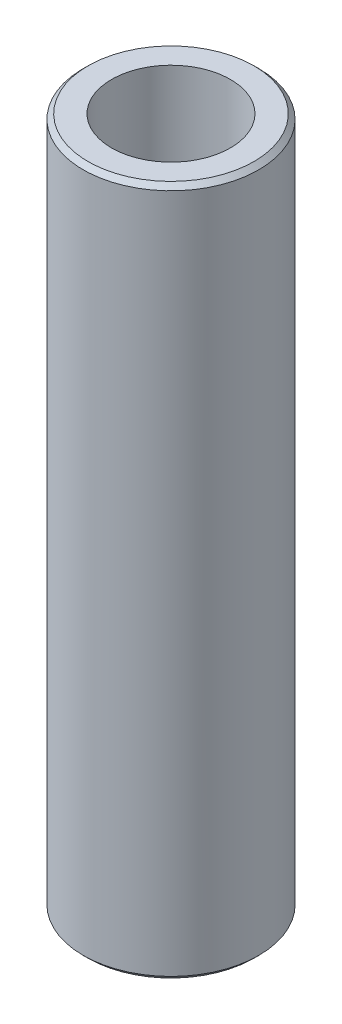
ISO-10303-21;
HEADER;
FILE_DESCRIPTION(('STEP AP214'),'2;1');
FILE_NAME('part.step','',(''),(''),'','','');
FILE_SCHEMA(('AUTOMOTIVE_DESIGN { 1 0 10303 214 1 1 1 1 }'));
ENDSEC;
DATA;
#1=APPLICATION_CONTEXT('core data for automotive mechanical design processes');
#2=APPLICATION_PROTOCOL_DEFINITION('international standard','automotive_design',2000,#1);
#3=PRODUCT_CONTEXT('',#1,'mechanical');
#4=PRODUCT('Part','Part','',(#3));
#5=PRODUCT_RELATED_PRODUCT_CATEGORY('part','',(#4));
#6=PRODUCT_DEFINITION_FORMATION('','',#4);
#7=PRODUCT_DEFINITION_CONTEXT('part definition',#1,'design');
#8=PRODUCT_DEFINITION('design','',#6,#7);
#9=PRODUCT_DEFINITION_SHAPE('','',#8);
#10=(LENGTH_UNIT() NAMED_UNIT(*) SI_UNIT(.MILLI.,.METRE.));
#11=(NAMED_UNIT(*) PLANE_ANGLE_UNIT() SI_UNIT($,.RADIAN.));
#12=(NAMED_UNIT(*) SI_UNIT($,.STERADIAN.) SOLID_ANGLE_UNIT());
#13=UNCERTAINTY_MEASURE_WITH_UNIT(LENGTH_MEASURE(1.E-05),#10,'distance_accuracy_value','');
#14=(GEOMETRIC_REPRESENTATION_CONTEXT(3) GLOBAL_UNCERTAINTY_ASSIGNED_CONTEXT((#13)) GLOBAL_UNIT_ASSIGNED_CONTEXT((#10,
#11,#12)) REPRESENTATION_CONTEXT('',''));
#15=CARTESIAN_POINT('',(0.,0.,0.));
#16=DIRECTION('',(0.,0.,1.));
#17=DIRECTION('',(1.,0.,0.));
#18=AXIS2_PLACEMENT_3D('',#15,#16,#17);
#19=CARTESIAN_POINT('',(0.,275.203548064163,0.));
#20=DIRECTION('',(0.,-1.,0.));
#21=DIRECTION('',(0.,0.,-1.));
#22=AXIS2_PLACEMENT_3D('',#19,#20,#21);
#23=CYLINDRICAL_SURFACE('',#22,35.);
#24=CARTESIAN_POINT('',(0.,273.301875092241,0.));
#25=DIRECTION('',(0.,1.,0.));
#26=DIRECTION('',(0.,0.,1.));
#27=AXIS2_PLACEMENT_3D('',#24,#25,#26);
#28=CIRCLE('',#27,35.);
#29=CARTESIAN_POINT('',(0.,273.301875092241,-35.));
#30=VERTEX_POINT('',#29);
#31=EDGE_CURVE('E50',#30,#30,#28,.F.);
#32=CARTESIAN_POINT('',(0.,1.90167297192195,0.));
#33=DIRECTION('',(0.,1.,0.));
#34=DIRECTION('',(0.,0.,1.));
#35=AXIS2_PLACEMENT_3D('',#32,#33,#34);
#36=CIRCLE('',#35,35.);
#37=CARTESIAN_POINT('',(0.,1.9016729719219,-35.));
#38=VERTEX_POINT('',#37);
#39=EDGE_CURVE('E51',#38,#38,#36,.T.);
#40=CARTESIAN_POINT('',(0.,273.301875092241,-35.));
#41=CARTESIAN_POINT('',(0.,270.474789653488,-35.));
#42=CARTESIAN_POINT('',(0.,267.647704214734,-35.));
#43=CARTESIAN_POINT('',(0.,261.993533337228,-35.));
#44=CARTESIAN_POINT('',(0.,259.166447898474,-35.));
#45=CARTESIAN_POINT('',(0.,253.512277020968,-35.));
#46=CARTESIAN_POINT('',(0.,250.685191582214,-35.));
#47=CARTESIAN_POINT('',(0.,245.031020704708,-35.));
#48=CARTESIAN_POINT('',(0.,242.203935265954,-35.));
#49=CARTESIAN_POINT('',(0.,236.549764388448,-35.));
#50=CARTESIAN_POINT('',(0.,233.722678949694,-35.));
#51=CARTESIAN_POINT('',(0.,228.068508072188,-35.));
#52=CARTESIAN_POINT('',(0.,225.241422633434,-35.));
#53=CARTESIAN_POINT('',(0.,219.587251755928,-35.));
#54=CARTESIAN_POINT('',(0.,216.760166317174,-35.));
#55=CARTESIAN_POINT('',(0.,211.105995439668,-35.));
#56=CARTESIAN_POINT('',(0.,208.278910000915,-35.));
#57=CARTESIAN_POINT('',(0.,202.624739123408,-35.));
#58=CARTESIAN_POINT('',(0.,199.797653684655,-35.));
#59=CARTESIAN_POINT('',(0.,194.143482807148,-35.));
#60=CARTESIAN_POINT('',(0.,191.316397368395,-35.));
#61=CARTESIAN_POINT('',(0.,185.662226490888,-35.));
#62=CARTESIAN_POINT('',(0.,182.835141052135,-35.));
#63=CARTESIAN_POINT('',(0.,177.180970174628,-35.));
#64=CARTESIAN_POINT('',(0.,174.353884735875,-35.));
#65=CARTESIAN_POINT('',(0.,168.699713858368,-35.));
#66=CARTESIAN_POINT('',(0.,165.872628419615,-35.));
#67=CARTESIAN_POINT('',(0.,160.218457542108,-35.));
#68=CARTESIAN_POINT('',(0.,157.391372103355,-35.));
#69=CARTESIAN_POINT('',(0.,151.737201225848,-35.));
#70=CARTESIAN_POINT('',(0.,148.910115787095,-35.));
#71=CARTESIAN_POINT('',(0.,143.255944909588,-35.));
#72=CARTESIAN_POINT('',(0.,140.428859470835,-35.));
#73=CARTESIAN_POINT('',(0.,134.774688593328,-35.));
#74=CARTESIAN_POINT('',(0.,131.947603154575,-35.));
#75=CARTESIAN_POINT('',(0.,126.293432277068,-35.));
#76=CARTESIAN_POINT('',(0.,123.466346838315,-35.));
#77=CARTESIAN_POINT('',(0.,117.812175960808,-35.));
#78=CARTESIAN_POINT('',(0.,114.985090522055,-35.));
#79=CARTESIAN_POINT('',(0.,109.330919644548,-35.));
#80=CARTESIAN_POINT('',(0.,106.503834205795,-35.));
#81=CARTESIAN_POINT('',(0.,100.849663328288,-35.));
#82=CARTESIAN_POINT('',(0.,98.0225778895349,-35.));
#83=CARTESIAN_POINT('',(0.,92.3684070120282,-35.));
#84=CARTESIAN_POINT('',(0.,89.5413215732749,-35.));
#85=CARTESIAN_POINT('',(0.,83.8871506957683,-35.));
#86=CARTESIAN_POINT('',(0.,81.060065257015,-35.));
#87=CARTESIAN_POINT('',(0.,75.4058943795083,-35.));
#88=CARTESIAN_POINT('',(0.,72.578808940755,-35.));
#89=CARTESIAN_POINT('',(0.,66.9246380632483,-35.));
#90=CARTESIAN_POINT('',(0.,64.097552624495,-35.));
#91=CARTESIAN_POINT('',(0.,58.4433817469884,-35.));
#92=CARTESIAN_POINT('',(0.,55.616296308235,-35.));
#93=CARTESIAN_POINT('',(0.,49.9621254307284,-35.));
#94=CARTESIAN_POINT('',(0.,47.1350399919751,-35.));
#95=CARTESIAN_POINT('',(0.,41.4808691144684,-35.));
#96=CARTESIAN_POINT('',(0.,38.6537836757151,-35.));
#97=CARTESIAN_POINT('',(0.,32.9996127982084,-35.));
#98=CARTESIAN_POINT('',(0.,30.1725273594551,-35.));
#99=CARTESIAN_POINT('',(0.,24.5183564819485,-35.));
#100=CARTESIAN_POINT('',(0.,21.6912710431951,-35.));
#101=CARTESIAN_POINT('',(0.,16.0371001656885,-35.));
#102=CARTESIAN_POINT('',(0.,13.2100147269352,-35.));
#103=CARTESIAN_POINT('',(0.,7.55584384942853,-35.));
#104=CARTESIAN_POINT('',(0.,4.72875841067522,-35.));
#105=CARTESIAN_POINT('',(0.,1.9016729719219,-35.));
#106=B_SPLINE_CURVE_WITH_KNOTS('',3,(#40,#41,#42,#43,#44,#45,#46,#47,#48,#49,#50,#51,#52,#53,
#54,#55,#56,#57,#58,#59,#60,#61,#62,#63,#64,#65,#66,#67,#68,#69,#70,#71,#72,#73,#74,#75,#76,#77,
#78,#79,#80,#81,#82,#83,#84,#85,#86,#87,#88,#89,#90,#91,#92,#93,#94,#95,#96,#97,#98,#99,#100,
#101,#102,#103,#104,#105),.UNSPECIFIED.,.F.,.F.,(4,2,2,2,2,2,2,2,2,2,2,2,2,2,2,2,2,2,2,2,2,2,2,
2,2,2,2,2,2,2,2,2,4),(0.,8.48125631626001,16.96251263252,25.4437689487799,33.9250252650399,
42.4062815812999,50.8875378975599,59.3687942138199,67.8500505300798,76.3313068463398,
84.8125631625997,93.2938194788597,101.77507579512,110.25633211138,118.73758842764,
127.2188447439,135.70010106016,144.18135737642,152.66261369268,161.14387000894,169.625126325199,
178.106382641459,186.587638957719,195.068895273979,203.550151590239,212.031407906499,
220.512664222759,228.993920539019,237.475176855279,245.956433171539,254.437689487799,
262.918945804059,271.400202120319),.UNSPECIFIED.);
#107=EDGE_CURVE('BSEAM39',#30,#38,#106,.T.);
#108=ORIENTED_EDGE('',*,*,#31,.T.);
#109=ORIENTED_EDGE('',*,*,#39,.T.);
#110=ORIENTED_EDGE('',*,*,#107,.T.);
#111=ORIENTED_EDGE('',*,*,#107,.F.);
#112=EDGE_LOOP('',(#108,#110,#109,#111));
#113=FACE_BOUND('',#112,.T.);
#114=ADVANCED_FACE('F39',(#113),#23,.T.);
#115=CARTESIAN_POINT('',(0.,275.203548064163,0.));
#116=DIRECTION('',(0.,1.,0.));
#117=DIRECTION('',(0.,0.,1.));
#118=AXIS2_PLACEMENT_3D('',#115,#116,#117);
#119=PLANE('',#118);
#120=CARTESIAN_POINT('',(0.,275.203548064163,0.));
#121=DIRECTION('',(0.,1.,0.));
#122=DIRECTION('',(0.,0.,1.));
#123=AXIS2_PLACEMENT_3D('',#120,#121,#122);
#124=CIRCLE('',#123,33.0983270280781);
#125=CARTESIAN_POINT('',(0.,275.203548064163,-33.0983270280781));
#126=VERTEX_POINT('',#125);
#127=EDGE_CURVE('E54',#126,#126,#124,.T.);
#128=ORIENTED_EDGE('',*,*,#127,.T.);
#129=EDGE_LOOP('',(#128));
#130=FACE_BOUND('',#129,.T.);
#131=CARTESIAN_POINT('',(0.,275.203548064163,0.));
#132=DIRECTION('',(0.,1.,0.));
#133=DIRECTION('',(0.,0.,1.));
#134=AXIS2_PLACEMENT_3D('',#131,#132,#133);
#135=CIRCLE('',#134,23.6991882400768);
#136=CARTESIAN_POINT('',(0.,275.203548064163,23.6991882400768));
#137=VERTEX_POINT('',#136);
#138=EDGE_CURVE('E58',#137,#137,#135,.T.);
#139=ORIENTED_EDGE('',*,*,#138,.F.);
#140=EDGE_LOOP('',(#139));
#141=FACE_BOUND('',#140,.T.);
#142=ADVANCED_FACE('F69',(#130,#141),#119,.T.);
#143=CARTESIAN_POINT('',(0.,0.,0.));
#144=DIRECTION('',(0.,1.,0.));
#145=DIRECTION('',(0.,0.,1.));
#146=AXIS2_PLACEMENT_3D('',#143,#144,#145);
#147=PLANE('',#146);
#148=CARTESIAN_POINT('',(0.,0.,0.));
#149=DIRECTION('',(0.,1.,0.));
#150=DIRECTION('',(0.,0.,1.));
#151=AXIS2_PLACEMENT_3D('',#148,#149,#150);
#152=CIRCLE('',#151,33.0983270280781);
#153=CARTESIAN_POINT('',(0.,0.,33.0983270280781));
#154=VERTEX_POINT('',#153);
#155=EDGE_CURVE('E10',#154,#154,#152,.F.);
#156=ORIENTED_EDGE('',*,*,#155,.T.);
#157=EDGE_LOOP('',(#156));
#158=FACE_BOUND('',#157,.T.);
#159=CARTESIAN_POINT('',(0.,0.,0.));
#160=DIRECTION('',(0.,1.,0.));
#161=DIRECTION('',(0.,0.,1.));
#162=AXIS2_PLACEMENT_3D('',#159,#160,#161);
#163=CIRCLE('',#162,23.6991882400768);
#164=CARTESIAN_POINT('',(0.,0.,23.6991882400768));
#165=VERTEX_POINT('',#164);
#166=EDGE_CURVE('E63',#165,#165,#163,.T.);
#167=ORIENTED_EDGE('',*,*,#166,.T.);
#168=EDGE_LOOP('',(#167));
#169=FACE_BOUND('',#168,.T.);
#170=ADVANCED_FACE('F75',(#158,#169),#147,.F.);
#171=CARTESIAN_POINT('',(0.,275.203548064163,0.));
#172=DIRECTION('',(0.,-1.,0.));
#173=DIRECTION('',(0.,0.,-1.));
#174=AXIS2_PLACEMENT_3D('',#171,#172,#173);
#175=CYLINDRICAL_SURFACE('',#174,23.6991882400768);
#176=ORIENTED_EDGE('',*,*,#138,.T.);
#177=EDGE_LOOP('',(#176));
#178=FACE_BOUND('',#177,.T.);
#179=ORIENTED_EDGE('',*,*,#166,.F.);
#180=EDGE_LOOP('',(#179));
#181=FACE_BOUND('',#180,.T.);
#182=ADVANCED_FACE('F70',(#178,#181),#175,.F.);
#183=CARTESIAN_POINT('',(0.,275.203548064163,0.));
#184=DIRECTION('',(0.,-1.,0.));
#185=DIRECTION('',(0.,0.,-1.));
#186=AXIS2_PLACEMENT_3D('',#183,#184,#185);
#187=CONICAL_SURFACE('',#186,33.0983270280781,0.785398163397436);
#188=CARTESIAN_POINT('',(0.,273.301875092241,-35.));
#189=CARTESIAN_POINT('',(0.,273.321684185699,-34.9801909065425));
#190=CARTESIAN_POINT('',(0.,273.341493279156,-34.960381813085));
#191=CARTESIAN_POINT('',(0.,273.381111466071,-34.92076362617));
#192=CARTESIAN_POINT('',(0.,273.400920559529,-34.9009545327124));
#193=CARTESIAN_POINT('',(0.,273.440538746444,-34.8613363457974));
#194=CARTESIAN_POINT('',(0.,273.460347839901,-34.8415272523399));
#195=CARTESIAN_POINT('',(0.,273.499966026816,-34.8019090654248));
#196=CARTESIAN_POINT('',(0.,273.519775120274,-34.7820999719673));
#197=CARTESIAN_POINT('',(0.,273.559393307189,-34.7424817850523));
#198=CARTESIAN_POINT('',(0.,273.579202400646,-34.7226726915948));
#199=CARTESIAN_POINT('',(0.,273.618820587561,-34.6830545046797));
#200=CARTESIAN_POINT('',(0.,273.638629681019,-34.6632454112222));
#201=CARTESIAN_POINT('',(0.,273.678247867934,-34.6236272243071));
#202=CARTESIAN_POINT('',(0.,273.698056961391,-34.6038181308496));
#203=CARTESIAN_POINT('',(0.,273.737675148306,-34.5641999439346));
#204=CARTESIAN_POINT('',(0.,273.757484241764,-34.5443908504771));
#205=CARTESIAN_POINT('',(0.,273.797102428679,-34.504772663562));
#206=CARTESIAN_POINT('',(0.,273.816911522137,-34.4849635701045));
#207=CARTESIAN_POINT('',(0.,273.856529709052,-34.4453453831895));
#208=CARTESIAN_POINT('',(0.,273.876338802509,-34.4255362897319));
#209=CARTESIAN_POINT('',(0.,273.915956989424,-34.3859181028169));
#210=CARTESIAN_POINT('',(0.,273.935766082882,-34.3661090093594));
#211=CARTESIAN_POINT('',(0.,273.975384269797,-34.3264908224443));
#212=CARTESIAN_POINT('',(0.,273.995193363254,-34.3066817289868));
#213=CARTESIAN_POINT('',(0.,274.034811550169,-34.2670635420718));
#214=CARTESIAN_POINT('',(0.,274.054620643627,-34.2472544486143));
#215=CARTESIAN_POINT('',(0.,274.094238830542,-34.2076362616992));
#216=CARTESIAN_POINT('',(0.,274.114047923999,-34.1878271682417));
#217=CARTESIAN_POINT('',(0.,274.153666110914,-34.1482089813267));
#218=CARTESIAN_POINT('',(0.,274.173475204372,-34.1283998878691));
#219=CARTESIAN_POINT('',(0.,274.213093391287,-34.0887817009541));
#220=CARTESIAN_POINT('',(0.,274.232902484744,-34.0689726074966));
#221=CARTESIAN_POINT('',(0.,274.27252067166,-34.0293544205815));
#222=CARTESIAN_POINT('',(0.,274.292329765117,-34.009545327124));
#223=CARTESIAN_POINT('',(0.,274.331947952032,-33.969927140209));
#224=CARTESIAN_POINT('',(0.,274.35175704549,-33.9501180467515));
#225=CARTESIAN_POINT('',(0.,274.391375232405,-33.9104998598364));
#226=CARTESIAN_POINT('',(0.,274.411184325862,-33.8906907663789));
#227=CARTESIAN_POINT('',(0.,274.450802512777,-33.8510725794639));
#228=CARTESIAN_POINT('',(0.,274.470611606235,-33.8312634860063));
#229=CARTESIAN_POINT('',(0.,274.51022979315,-33.7916452990913));
#230=CARTESIAN_POINT('',(0.,274.530038886607,-33.7718362056338));
#231=CARTESIAN_POINT('',(0.,274.569657073522,-33.7322180187187));
#232=CARTESIAN_POINT('',(0.,274.58946616698,-33.7124089252612));
#233=CARTESIAN_POINT('',(0.,274.629084353895,-33.6727907383462));
#234=CARTESIAN_POINT('',(0.,274.648893447352,-33.6529816448887));
#235=CARTESIAN_POINT('',(0.,274.688511634267,-33.6133634579736));
#236=CARTESIAN_POINT('',(0.,274.708320727725,-33.5935543645161));
#237=CARTESIAN_POINT('',(0.,274.74793891464,-33.553936177601));
#238=CARTESIAN_POINT('',(0.,274.767748008098,-33.5341270841435));
#239=CARTESIAN_POINT('',(0.,274.807366195013,-33.4945088972285));
#240=CARTESIAN_POINT('',(0.,274.82717528847,-33.474699803771));
#241=CARTESIAN_POINT('',(0.,274.866793475385,-33.4350816168559));
#242=CARTESIAN_POINT('',(0.,274.886602568843,-33.4152725233984));
#243=CARTESIAN_POINT('',(0.,274.926220755758,-33.3756543364834));
#244=CARTESIAN_POINT('',(0.,274.946029849215,-33.3558452430258));
#245=CARTESIAN_POINT('',(0.,274.98564803613,-33.3162270561108));
#246=CARTESIAN_POINT('',(0.,275.005457129588,-33.2964179626533));
#247=CARTESIAN_POINT('',(0.,275.045075316503,-33.2567997757382));
#248=CARTESIAN_POINT('',(0.,275.06488440996,-33.2369906822807));
#249=CARTESIAN_POINT('',(0.,275.104502596875,-33.1973724953657));
#250=CARTESIAN_POINT('',(0.,275.124311690333,-33.1775634019082));
#251=CARTESIAN_POINT('',(0.,275.163929877248,-33.1379452149931));
#252=CARTESIAN_POINT('',(0.,275.183738970705,-33.1181361215356));
#253=CARTESIAN_POINT('',(0.,275.203548064163,-33.0983270280781));
#254=B_SPLINE_CURVE_WITH_KNOTS('',3,(#188,#189,#190,#191,#192,#193,#194,#195,#196,#197,#198,
#199,#200,#201,#202,#203,#204,#205,#206,#207,#208,#209,#210,#211,#212,#213,#214,#215,#216,#217,
#218,#219,#220,#221,#222,#223,#224,#225,#226,#227,#228,#229,#230,#231,#232,#233,#234,#235,#236,
#237,#238,#239,#240,#241,#242,#243,#244,#245,#246,#247,#248,#249,#250,#251,#252,#253),
.UNSPECIFIED.,.F.,.F.,(4,2,2,2,2,2,2,2,2,2,2,2,2,2,2,2,2,2,2,2,2,2,2,2,2,2,2,2,2,2,2,2,4),(0.,
0.084042865877861,0.168085731755683,0.25212859763351,0.336171463511331,0.420214329389153,
0.50425719526698,0.588300061144802,0.672342927022623,0.756385792900445,0.840428658778272,
0.924471524656094,1.00851439053392,1.09255725641174,1.17660012228956,1.26064298816739,
1.34468585404521,1.42872871992307,1.5127715858009,1.59681445167872,1.68085731755654,
1.76490018343437,1.84894304931219,1.93298591519001,2.01702878106784,2.10107164694566,
2.18511451282348,2.26915737870131,2.35320024457913,2.43724311045695,2.52128597633477,
2.6053288422126,2.68937170809046),.UNSPECIFIED.);
#255=EDGE_CURVE('BSEAM81',#30,#126,#254,.T.);
#256=ORIENTED_EDGE('',*,*,#31,.F.);
#257=ORIENTED_EDGE('',*,*,#127,.F.);
#258=ORIENTED_EDGE('',*,*,#255,.T.);
#259=ORIENTED_EDGE('',*,*,#255,.F.);
#260=EDGE_LOOP('',(#256,#258,#257,#259));
#261=FACE_BOUND('',#260,.T.);
#262=ADVANCED_FACE('F81',(#261),#187,.T.);
#263=CARTESIAN_POINT('',(0.,1.90167297192195,0.));
#264=DIRECTION('',(0.,1.,0.));
#265=DIRECTION('',(0.,0.,1.));
#266=AXIS2_PLACEMENT_3D('',#263,#264,#265);
#267=CONICAL_SURFACE('',#266,35.,0.785398163397443);
#268=ORIENTED_EDGE('',*,*,#155,.F.);
#269=EDGE_LOOP('',(#268));
#270=FACE_BOUND('',#269,.T.);
#271=ORIENTED_EDGE('',*,*,#39,.F.);
#272=EDGE_LOOP('',(#271));
#273=FACE_BOUND('',#272,.T.);
#274=ADVANCED_FACE('F45',(#270,#273),#267,.T.);
#275=CLOSED_SHELL('',(#114,#142,#170,#182,#262,#274));
#276=MANIFOLD_SOLID_BREP('B2',#275);
#277=ADVANCED_BREP_SHAPE_REPRESENTATION('',(#18,#276),#14);
#278=SHAPE_DEFINITION_REPRESENTATION(#9,#277);
ENDSEC;
END-ISO-10303-21;
